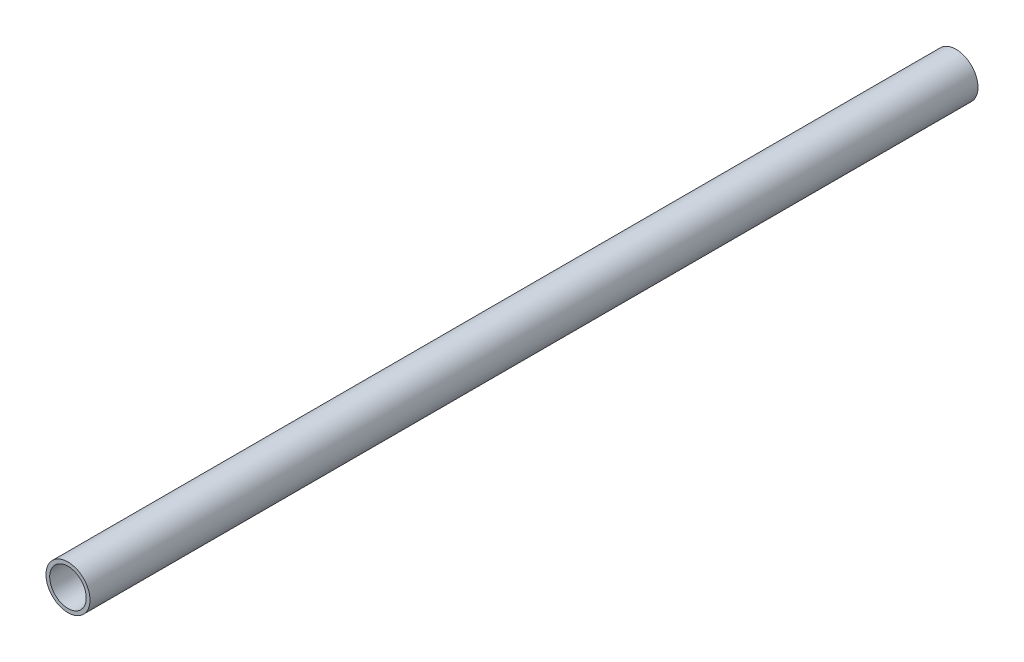
ISO-10303-21;
HEADER;
FILE_DESCRIPTION(('STEP AP214'),'2;1');
FILE_NAME('part.step','',(''),(''),'','','');
FILE_SCHEMA(('AUTOMOTIVE_DESIGN { 1 0 10303 214 1 1 1 1 }'));
ENDSEC;
DATA;
#1=APPLICATION_CONTEXT('core data for automotive mechanical design processes');
#2=APPLICATION_PROTOCOL_DEFINITION('international standard','automotive_design',2000,#1);
#3=PRODUCT_CONTEXT('',#1,'mechanical');
#4=PRODUCT('Part','Part','',(#3));
#5=PRODUCT_RELATED_PRODUCT_CATEGORY('part','',(#4));
#6=PRODUCT_DEFINITION_FORMATION('','',#4);
#7=PRODUCT_DEFINITION_CONTEXT('part definition',#1,'design');
#8=PRODUCT_DEFINITION('design','',#6,#7);
#9=PRODUCT_DEFINITION_SHAPE('','',#8);
#10=(LENGTH_UNIT() NAMED_UNIT(*) SI_UNIT(.MILLI.,.METRE.));
#11=(NAMED_UNIT(*) PLANE_ANGLE_UNIT() SI_UNIT($,.RADIAN.));
#12=(NAMED_UNIT(*) SI_UNIT($,.STERADIAN.) SOLID_ANGLE_UNIT());
#13=UNCERTAINTY_MEASURE_WITH_UNIT(LENGTH_MEASURE(1.E-05),#10,'distance_accuracy_value','');
#14=(GEOMETRIC_REPRESENTATION_CONTEXT(3) GLOBAL_UNCERTAINTY_ASSIGNED_CONTEXT((#13)) GLOBAL_UNIT_ASSIGNED_CONTEXT((#10,
#11,#12)) REPRESENTATION_CONTEXT('',''));
#15=CARTESIAN_POINT('',(0.,0.,0.));
#16=DIRECTION('',(0.,0.,1.));
#17=DIRECTION('',(1.,0.,0.));
#18=AXIS2_PLACEMENT_3D('',#15,#16,#17);
#19=CARTESIAN_POINT('',(0.,0.,0.));
#20=DIRECTION('',(0.,0.,1.));
#21=DIRECTION('',(1.,0.,0.));
#22=AXIS2_PLACEMENT_3D('',#19,#20,#21);
#23=CYLINDRICAL_SURFACE('',#22,17.526);
#24=CARTESIAN_POINT('',(0.,0.,0.));
#25=DIRECTION('',(0.,0.,1.));
#26=DIRECTION('',(1.,0.,0.));
#27=AXIS2_PLACEMENT_3D('',#24,#25,#26);
#28=CIRCLE('',#27,17.526);
#29=CARTESIAN_POINT('',(17.526,0.,0.));
#30=VERTEX_POINT('',#29);
#31=EDGE_CURVE('E27',#30,#30,#28,.F.);
#32=ORIENTED_EDGE('',*,*,#31,.T.);
#33=EDGE_LOOP('',(#32));
#34=FACE_BOUND('',#33,.T.);
#35=CARTESIAN_POINT('',(0.,0.,850.9));
#36=DIRECTION('',(0.,0.,1.));
#37=DIRECTION('',(1.,0.,0.));
#38=AXIS2_PLACEMENT_3D('',#35,#36,#37);
#39=CIRCLE('',#38,17.526);
#40=CARTESIAN_POINT('',(17.526,0.,850.9));
#41=VERTEX_POINT('',#40);
#42=EDGE_CURVE('E18',#41,#41,#39,.F.);
#43=ORIENTED_EDGE('',*,*,#42,.F.);
#44=EDGE_LOOP('',(#43));
#45=FACE_BOUND('',#44,.T.);
#46=ADVANCED_FACE('F15',(#34,#45),#23,.F.);
#47=CARTESIAN_POINT('',(0.,0.,850.9));
#48=DIRECTION('',(0.,0.,1.));
#49=DIRECTION('',(1.,0.,0.));
#50=AXIS2_PLACEMENT_3D('',#47,#48,#49);
#51=PLANE('',#50);
#52=ORIENTED_EDGE('',*,*,#42,.T.);
#53=EDGE_LOOP('',(#52));
#54=FACE_BOUND('',#53,.T.);
#55=CARTESIAN_POINT('',(0.,0.,850.9));
#56=DIRECTION('',(0.,0.,1.));
#57=DIRECTION('',(1.,0.,0.));
#58=AXIS2_PLACEMENT_3D('',#55,#56,#57);
#59=CIRCLE('',#58,21.082);
#60=CARTESIAN_POINT('',(21.082,0.,850.9));
#61=VERTEX_POINT('',#60);
#62=EDGE_CURVE('E22',#61,#61,#59,.F.);
#63=ORIENTED_EDGE('',*,*,#62,.F.);
#64=EDGE_LOOP('',(#63));
#65=FACE_BOUND('',#64,.T.);
#66=ADVANCED_FACE('F35',(#54,#65),#51,.T.);
#67=CARTESIAN_POINT('',(0.,0.,0.));
#68=DIRECTION('',(0.,0.,1.));
#69=DIRECTION('',(1.,0.,0.));
#70=AXIS2_PLACEMENT_3D('',#67,#68,#69);
#71=PLANE('',#70);
#72=ORIENTED_EDGE('',*,*,#31,.F.);
#73=EDGE_LOOP('',(#72));
#74=FACE_BOUND('',#73,.T.);
#75=CARTESIAN_POINT('',(0.,0.,0.));
#76=DIRECTION('',(0.,0.,1.));
#77=DIRECTION('',(1.,0.,0.));
#78=AXIS2_PLACEMENT_3D('',#75,#76,#77);
#79=CIRCLE('',#78,21.082);
#80=CARTESIAN_POINT('',(21.082,0.,0.));
#81=VERTEX_POINT('',#80);
#82=EDGE_CURVE('E10',#81,#81,#79,.T.);
#83=ORIENTED_EDGE('',*,*,#82,.F.);
#84=EDGE_LOOP('',(#83));
#85=FACE_BOUND('',#84,.T.);
#86=ADVANCED_FACE('F43',(#74,#85),#71,.F.);
#87=CARTESIAN_POINT('',(0.,0.,0.));
#88=DIRECTION('',(0.,0.,1.));
#89=DIRECTION('',(1.,0.,0.));
#90=AXIS2_PLACEMENT_3D('',#87,#88,#89);
#91=CYLINDRICAL_SURFACE('',#90,21.082);
#92=ORIENTED_EDGE('',*,*,#82,.T.);
#93=EDGE_LOOP('',(#92));
#94=FACE_BOUND('',#93,.T.);
#95=ORIENTED_EDGE('',*,*,#62,.T.);
#96=EDGE_LOOP('',(#95));
#97=FACE_BOUND('',#96,.T.);
#98=ADVANCED_FACE('F44',(#94,#97),#91,.T.);
#99=CLOSED_SHELL('',(#46,#66,#86,#98));
#100=MANIFOLD_SOLID_BREP('B1',#99);
#101=ADVANCED_BREP_SHAPE_REPRESENTATION('',(#18,#100),#14);
#102=SHAPE_DEFINITION_REPRESENTATION(#9,#101);
ENDSEC;
END-ISO-10303-21;
